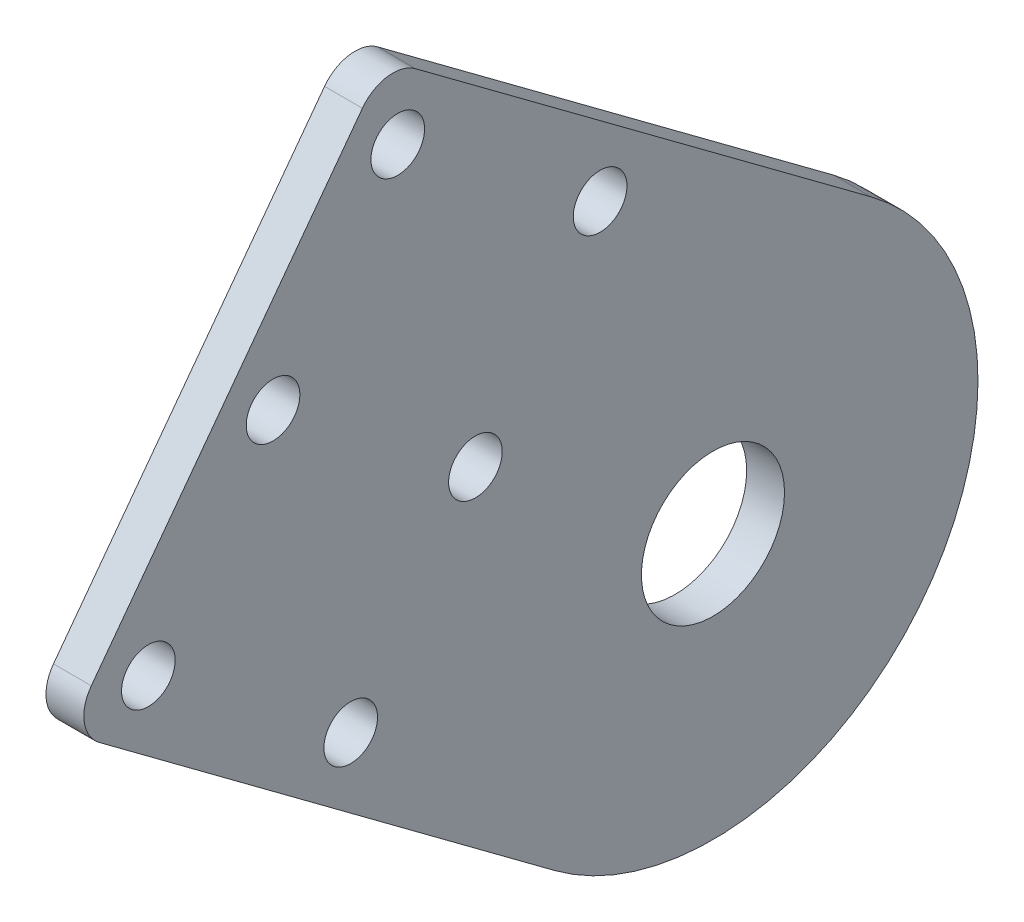
ISO-10303-21;
HEADER;
FILE_DESCRIPTION(('STEP AP214'),'2;1');
FILE_NAME('part.step','',(''),(''),'','','');
FILE_SCHEMA(('AUTOMOTIVE_DESIGN { 1 0 10303 214 1 1 1 1 }'));
ENDSEC;
DATA;
#1=APPLICATION_CONTEXT('core data for automotive mechanical design processes');
#2=APPLICATION_PROTOCOL_DEFINITION('international standard','automotive_design',2000,#1);
#3=PRODUCT_CONTEXT('',#1,'mechanical');
#4=PRODUCT('Part','Part','',(#3));
#5=PRODUCT_RELATED_PRODUCT_CATEGORY('part','',(#4));
#6=PRODUCT_DEFINITION_FORMATION('','',#4);
#7=PRODUCT_DEFINITION_CONTEXT('part definition',#1,'design');
#8=PRODUCT_DEFINITION('design','',#6,#7);
#9=PRODUCT_DEFINITION_SHAPE('','',#8);
#10=(LENGTH_UNIT() NAMED_UNIT(*) SI_UNIT(.MILLI.,.METRE.));
#11=(NAMED_UNIT(*) PLANE_ANGLE_UNIT() SI_UNIT($,.RADIAN.));
#12=(NAMED_UNIT(*) SI_UNIT($,.STERADIAN.) SOLID_ANGLE_UNIT());
#13=UNCERTAINTY_MEASURE_WITH_UNIT(LENGTH_MEASURE(1.E-05),#10,'distance_accuracy_value','');
#14=(GEOMETRIC_REPRESENTATION_CONTEXT(3) GLOBAL_UNCERTAINTY_ASSIGNED_CONTEXT((#13)) GLOBAL_UNIT_ASSIGNED_CONTEXT((#10,
#11,#12)) REPRESENTATION_CONTEXT('',''));
#15=CARTESIAN_POINT('',(0.,0.,0.));
#16=DIRECTION('',(0.,0.,1.));
#17=DIRECTION('',(1.,0.,0.));
#18=AXIS2_PLACEMENT_3D('',#15,#16,#17);
#19=CARTESIAN_POINT('',(3.175,87.5000000000012,-398.98926197498));
#20=DIRECTION('',(1.,0.,0.));
#21=DIRECTION('',(0.,0.,-1.));
#22=AXIS2_PLACEMENT_3D('',#19,#20,#21);
#23=PLANE('',#22);
#24=CARTESIAN_POINT('',(3.175,114.932192950069,-362.096397272571));
#25=DIRECTION('',(1.,0.,0.));
#26=DIRECTION('',(0.,0.,-1.));
#27=AXIS2_PLACEMENT_3D('',#24,#25,#26);
#28=CIRCLE('',#27,2.24999999999995);
#29=CARTESIAN_POINT('',(3.175,114.932192950069,-364.346397272571));
#30=VERTEX_POINT('',#29);
#31=EDGE_CURVE('E209',#30,#30,#28,.T.);
#32=ORIENTED_EDGE('',*,*,#31,.F.);
#33=EDGE_LOOP('',(#32));
#34=FACE_BOUND('',#33,.T.);
#35=CARTESIAN_POINT('',(3.175,128.996323692976,-372.553973590553));
#36=DIRECTION('',(1.,0.,0.));
#37=DIRECTION('',(0.,0.,-1.));
#38=AXIS2_PLACEMENT_3D('',#35,#36,#37);
#39=CIRCLE('',#38,2.24999999999996);
#40=CARTESIAN_POINT('',(3.175,128.996323692976,-374.803973590553));
#41=VERTEX_POINT('',#40);
#42=EDGE_CURVE('E221',#41,#41,#39,.T.);
#43=ORIENTED_EDGE('',*,*,#42,.F.);
#44=EDGE_LOOP('',(#43));
#45=FACE_BOUND('',#44,.T.);
#46=CARTESIAN_POINT('',(3.175,100.868062207161,-351.63882095459));
#47=DIRECTION('',(1.,0.,0.));
#48=DIRECTION('',(0.,0.,-1.));
#49=AXIS2_PLACEMENT_3D('',#46,#47,#48);
#50=CIRCLE('',#49,2.25000000000001);
#51=CARTESIAN_POINT('',(3.175,100.868062207161,-353.88882095459));
#52=VERTEX_POINT('',#51);
#53=EDGE_CURVE('E233',#52,#52,#50,.T.);
#54=ORIENTED_EDGE('',*,*,#53,.F.);
#55=EDGE_LOOP('',(#54));
#56=FACE_BOUND('',#55,.T.);
#57=CARTESIAN_POINT('',(3.175,87.5000000000012,-398.98926197498));
#58=DIRECTION('',(1.,0.,0.));
#59=DIRECTION('',(0.,0.,-1.));
#60=AXIS2_PLACEMENT_3D('',#57,#58,#59);
#61=CIRCLE('',#60,22.225);
#62=CARTESIAN_POINT('',(3.175,69.6650515941403,-385.727842731163));
#63=VERTEX_POINT('',#62);
#64=CARTESIAN_POINT('',(3.175,105.334948405862,-412.250681218797));
#65=VERTEX_POINT('',#64);
#66=EDGE_CURVE('E137',#63,#65,#61,.T.);
#67=ORIENTED_EDGE('',*,*,#66,.T.);
#68=DIRECTION('',(0.,0.596689279811797,0.802472369217582));
#69=VECTOR('',#68,1.);
#70=CARTESIAN_POINT('',(3.175,133.752275356899,-374.03293463481));
#71=LINE('',#70,#69);
#72=CARTESIAN_POINT('',(3.175,133.752275356899,-374.03293463481));
#73=VERTEX_POINT('',#72);
#74=EDGE_CURVE('E95',#65,#73,#71,.T.);
#75=ORIENTED_EDGE('',*,*,#74,.T.);
#76=CARTESIAN_POINT('',(3.175,131.204425584633,-372.138446171408));
#77=DIRECTION('',(1.,0.,0.));
#78=DIRECTION('',(0.,0.,1.));
#79=AXIS2_PLACEMENT_3D('',#76,#77,#78);
#80=CIRCLE('',#79,3.17500000000001);
#81=CARTESIAN_POINT('',(3.175,133.098914048035,-369.590596399142));
#82=VERTEX_POINT('',#81);
#83=EDGE_CURVE('E108',#73,#82,#80,.T.);
#84=ORIENTED_EDGE('',*,*,#83,.T.);
#85=DIRECTION('',(0.,-0.802472369217581,0.596689279811799));
#86=VECTOR('',#85,1.);
#87=CARTESIAN_POINT('',(3.175,102.524716780845,-346.856734838312));
#88=LINE('',#87,#86);
#89=CARTESIAN_POINT('',(3.175,102.524716780845,-346.856734838312));
#90=VERTEX_POINT('',#89);
#91=EDGE_CURVE('E102',#82,#90,#88,.T.);
#92=ORIENTED_EDGE('',*,*,#91,.T.);
#93=CARTESIAN_POINT('',(3.175,100.630228317443,-349.404584610578));
#94=DIRECTION('',(1.,0.,0.));
#95=DIRECTION('',(0.,0.,1.));
#96=AXIS2_PLACEMENT_3D('',#93,#94,#95);
#97=CIRCLE('',#96,3.17500000000002);
#98=CARTESIAN_POINT('',(3.175,98.0823785451771,-347.510096147176));
#99=VERTEX_POINT('',#98);
#100=EDGE_CURVE('E106',#90,#99,#97,.T.);
#101=ORIENTED_EDGE('',*,*,#100,.T.);
#102=DIRECTION('',(0.,-0.596689279811799,-0.802472369217581));
#103=VECTOR('',#102,1.);
#104=CARTESIAN_POINT('',(3.175,69.6650515941403,-385.727842731163));
#105=LINE('',#104,#103);
#106=EDGE_CURVE('E58',#99,#63,#105,.T.);
#107=ORIENTED_EDGE('',*,*,#106,.T.);
#108=EDGE_LOOP('',(#67,#75,#84,#92,#101,#107));
#109=FACE_BOUND('',#108,.T.);
#110=CARTESIAN_POINT('',(3.175,87.5000000000012,-398.98926197498));
#111=DIRECTION('',(1.,0.,0.));
#112=DIRECTION('',(0.,0.,-1.));
#113=AXIS2_PLACEMENT_3D('',#110,#111,#112);
#114=CIRCLE('',#113,5.99999999999999);
#115=CARTESIAN_POINT('',(3.175,87.5000000000012,-404.98926197498));
#116=VERTEX_POINT('',#115);
#117=EDGE_CURVE('E130',#116,#116,#114,.T.);
#118=ORIENTED_EDGE('',*,*,#117,.F.);
#119=EDGE_LOOP('',(#118));
#120=FACE_BOUND('',#119,.T.);
#121=CARTESIAN_POINT('',(3.175,88.2492773177012,-368.609506618803));
#122=DIRECTION('',(1.,0.,0.));
#123=DIRECTION('',(0.,0.,-1.));
#124=AXIS2_PLACEMENT_3D('',#121,#122,#123);
#125=CIRCLE('',#124,2.25000000000001);
#126=CARTESIAN_POINT('',(3.175,88.2492773177012,-370.859506618803));
#127=VERTEX_POINT('',#126);
#128=EDGE_CURVE('E227',#127,#127,#125,.T.);
#129=ORIENTED_EDGE('',*,*,#128,.F.);
#130=EDGE_LOOP('',(#129));
#131=FACE_BOUND('',#130,.T.);
#132=CARTESIAN_POINT('',(3.175,116.377538803516,-389.524659254767));
#133=DIRECTION('',(1.,0.,0.));
#134=DIRECTION('',(0.,0.,-1.));
#135=AXIS2_PLACEMENT_3D('',#132,#133,#134);
#136=CIRCLE('',#135,2.24999999999995);
#137=CARTESIAN_POINT('',(3.175,116.377538803516,-391.774659254767));
#138=VERTEX_POINT('',#137);
#139=EDGE_CURVE('E215',#138,#138,#136,.T.);
#140=ORIENTED_EDGE('',*,*,#139,.F.);
#141=EDGE_LOOP('',(#140));
#142=FACE_BOUND('',#141,.T.);
#143=CARTESIAN_POINT('',(3.175,102.313408060608,-379.067082936785));
#144=DIRECTION('',(1.,0.,0.));
#145=DIRECTION('',(0.,0.,-1.));
#146=AXIS2_PLACEMENT_3D('',#143,#144,#145);
#147=CIRCLE('',#146,2.24999999999995);
#148=CARTESIAN_POINT('',(3.175,102.313408060608,-381.317082936785));
#149=VERTEX_POINT('',#148);
#150=EDGE_CURVE('E200',#149,#149,#147,.T.);
#151=ORIENTED_EDGE('',*,*,#150,.F.);
#152=EDGE_LOOP('',(#151));
#153=FACE_BOUND('',#152,.T.);
#154=ADVANCED_FACE('F41',(#34,#45,#56,#109,#120,#131,#142,#153),#23,.T.);
#155=CARTESIAN_POINT('',(0.,87.5000000000012,-398.98926197498));
#156=DIRECTION('',(1.,0.,0.));
#157=DIRECTION('',(0.,0.,-1.));
#158=AXIS2_PLACEMENT_3D('',#155,#156,#157);
#159=PLANE('',#158);
#160=CARTESIAN_POINT('',(0.,87.5000000000012,-398.98926197498));
#161=DIRECTION('',(1.,0.,0.));
#162=DIRECTION('',(0.,0.,-1.));
#163=AXIS2_PLACEMENT_3D('',#160,#161,#162);
#164=CIRCLE('',#163,22.225);
#165=CARTESIAN_POINT('',(0.,69.6650515941403,-385.727842731163));
#166=VERTEX_POINT('',#165);
#167=CARTESIAN_POINT('',(0.,105.334948405862,-412.250681218797));
#168=VERTEX_POINT('',#167);
#169=EDGE_CURVE('E126',#166,#168,#164,.T.);
#170=ORIENTED_EDGE('',*,*,#169,.F.);
#171=DIRECTION('',(0.,-0.596689279811799,-0.802472369217581));
#172=VECTOR('',#171,1.);
#173=CARTESIAN_POINT('',(0.,69.6650515941403,-385.727842731163));
#174=LINE('',#173,#172);
#175=CARTESIAN_POINT('',(0.,98.0823785451771,-347.510096147176));
#176=VERTEX_POINT('',#175);
#177=EDGE_CURVE('E87',#176,#166,#174,.T.);
#178=ORIENTED_EDGE('',*,*,#177,.F.);
#179=CARTESIAN_POINT('',(0.,100.630228317443,-349.404584610578));
#180=DIRECTION('',(1.,0.,0.));
#181=DIRECTION('',(0.,0.,1.));
#182=AXIS2_PLACEMENT_3D('',#179,#180,#181);
#183=CIRCLE('',#182,3.17500000000002);
#184=CARTESIAN_POINT('',(0.,102.524716780845,-346.856734838312));
#185=VERTEX_POINT('',#184);
#186=EDGE_CURVE('E81',#185,#176,#183,.T.);
#187=ORIENTED_EDGE('',*,*,#186,.F.);
#188=DIRECTION('',(0.,-0.802472369217581,0.596689279811799));
#189=VECTOR('',#188,1.);
#190=CARTESIAN_POINT('',(0.,102.524716780845,-346.856734838312));
#191=LINE('',#190,#189);
#192=CARTESIAN_POINT('',(0.,133.098914048035,-369.590596399142));
#193=VERTEX_POINT('',#192);
#194=EDGE_CURVE('E116',#193,#185,#191,.T.);
#195=ORIENTED_EDGE('',*,*,#194,.F.);
#196=CARTESIAN_POINT('',(0.,131.204425584633,-372.138446171408));
#197=DIRECTION('',(1.,0.,0.));
#198=DIRECTION('',(0.,0.,1.));
#199=AXIS2_PLACEMENT_3D('',#196,#197,#198);
#200=CIRCLE('',#199,3.17500000000001);
#201=CARTESIAN_POINT('',(0.,133.752275356899,-374.03293463481));
#202=VERTEX_POINT('',#201);
#203=EDGE_CURVE('E132',#202,#193,#200,.T.);
#204=ORIENTED_EDGE('',*,*,#203,.F.);
#205=DIRECTION('',(0.,0.596689279811797,0.802472369217582));
#206=VECTOR('',#205,1.);
#207=CARTESIAN_POINT('',(0.,133.752275356899,-374.03293463481));
#208=LINE('',#207,#206);
#209=EDGE_CURVE('E129',#168,#202,#208,.T.);
#210=ORIENTED_EDGE('',*,*,#209,.F.);
#211=EDGE_LOOP('',(#170,#178,#187,#195,#204,#210));
#212=FACE_BOUND('',#211,.T.);
#213=CARTESIAN_POINT('',(0.,87.5000000000012,-398.98926197498));
#214=DIRECTION('',(1.,0.,0.));
#215=DIRECTION('',(0.,0.,-1.));
#216=AXIS2_PLACEMENT_3D('',#213,#214,#215);
#217=CIRCLE('',#216,5.99999999999999);
#218=CARTESIAN_POINT('',(0.,87.5000000000012,-404.98926197498));
#219=VERTEX_POINT('',#218);
#220=EDGE_CURVE('E236',#219,#219,#217,.T.);
#221=ORIENTED_EDGE('',*,*,#220,.T.);
#222=EDGE_LOOP('',(#221));
#223=FACE_BOUND('',#222,.T.);
#224=CARTESIAN_POINT('',(0.,100.868062207161,-351.63882095459));
#225=DIRECTION('',(1.,0.,0.));
#226=DIRECTION('',(0.,0.,-1.));
#227=AXIS2_PLACEMENT_3D('',#224,#225,#226);
#228=CIRCLE('',#227,2.25000000000001);
#229=CARTESIAN_POINT('',(0.,100.868062207161,-353.88882095459));
#230=VERTEX_POINT('',#229);
#231=EDGE_CURVE('E230',#230,#230,#228,.T.);
#232=ORIENTED_EDGE('',*,*,#231,.T.);
#233=EDGE_LOOP('',(#232));
#234=FACE_BOUND('',#233,.T.);
#235=CARTESIAN_POINT('',(0.,88.2492773177012,-368.609506618803));
#236=DIRECTION('',(1.,0.,0.));
#237=DIRECTION('',(0.,0.,-1.));
#238=AXIS2_PLACEMENT_3D('',#235,#236,#237);
#239=CIRCLE('',#238,2.25000000000001);
#240=CARTESIAN_POINT('',(0.,88.2492773177012,-370.859506618803));
#241=VERTEX_POINT('',#240);
#242=EDGE_CURVE('E224',#241,#241,#239,.T.);
#243=ORIENTED_EDGE('',*,*,#242,.T.);
#244=EDGE_LOOP('',(#243));
#245=FACE_BOUND('',#244,.T.);
#246=CARTESIAN_POINT('',(0.,128.996323692976,-372.553973590553));
#247=DIRECTION('',(1.,0.,0.));
#248=DIRECTION('',(0.,0.,-1.));
#249=AXIS2_PLACEMENT_3D('',#246,#247,#248);
#250=CIRCLE('',#249,2.24999999999996);
#251=CARTESIAN_POINT('',(0.,128.996323692976,-374.803973590553));
#252=VERTEX_POINT('',#251);
#253=EDGE_CURVE('E218',#252,#252,#250,.T.);
#254=ORIENTED_EDGE('',*,*,#253,.T.);
#255=EDGE_LOOP('',(#254));
#256=FACE_BOUND('',#255,.T.);
#257=CARTESIAN_POINT('',(0.,116.377538803516,-389.524659254767));
#258=DIRECTION('',(1.,0.,0.));
#259=DIRECTION('',(0.,0.,-1.));
#260=AXIS2_PLACEMENT_3D('',#257,#258,#259);
#261=CIRCLE('',#260,2.24999999999995);
#262=CARTESIAN_POINT('',(0.,116.377538803516,-391.774659254767));
#263=VERTEX_POINT('',#262);
#264=EDGE_CURVE('E212',#263,#263,#261,.T.);
#265=ORIENTED_EDGE('',*,*,#264,.T.);
#266=EDGE_LOOP('',(#265));
#267=FACE_BOUND('',#266,.T.);
#268=CARTESIAN_POINT('',(0.,114.932192950069,-362.096397272571));
#269=DIRECTION('',(1.,0.,0.));
#270=DIRECTION('',(0.,0.,-1.));
#271=AXIS2_PLACEMENT_3D('',#268,#269,#270);
#272=CIRCLE('',#271,2.24999999999995);
#273=CARTESIAN_POINT('',(0.,114.932192950069,-364.346397272571));
#274=VERTEX_POINT('',#273);
#275=EDGE_CURVE('E206',#274,#274,#272,.T.);
#276=ORIENTED_EDGE('',*,*,#275,.T.);
#277=EDGE_LOOP('',(#276));
#278=FACE_BOUND('',#277,.T.);
#279=CARTESIAN_POINT('',(0.,102.313408060608,-379.067082936785));
#280=DIRECTION('',(1.,0.,0.));
#281=DIRECTION('',(0.,0.,-1.));
#282=AXIS2_PLACEMENT_3D('',#279,#280,#281);
#283=CIRCLE('',#282,2.24999999999995);
#284=CARTESIAN_POINT('',(0.,102.313408060608,-381.317082936785));
#285=VERTEX_POINT('',#284);
#286=EDGE_CURVE('E203',#285,#285,#283,.T.);
#287=ORIENTED_EDGE('',*,*,#286,.T.);
#288=EDGE_LOOP('',(#287));
#289=FACE_BOUND('',#288,.T.);
#290=ADVANCED_FACE('F146',(#212,#223,#234,#245,#256,#267,#278,#289),#159,.F.);
#291=CARTESIAN_POINT('',(3.175,87.5000000000012,-398.98926197498));
#292=DIRECTION('',(-1.,0.,0.));
#293=DIRECTION('',(0.,0.,1.));
#294=AXIS2_PLACEMENT_3D('',#291,#292,#293);
#295=CYLINDRICAL_SURFACE('',#294,22.225);
#296=ORIENTED_EDGE('',*,*,#169,.T.);
#297=DIRECTION('',(-1.,0.,0.));
#298=VECTOR('',#297,1.);
#299=CARTESIAN_POINT('',(3.175,105.334948405862,-412.250681218797));
#300=LINE('',#299,#298);
#301=EDGE_CURVE('E11',#65,#168,#300,.T.);
#302=ORIENTED_EDGE('',*,*,#301,.F.);
#303=ORIENTED_EDGE('',*,*,#66,.F.);
#304=DIRECTION('',(-1.,0.,0.));
#305=VECTOR('',#304,1.);
#306=CARTESIAN_POINT('',(3.175,69.6650515941403,-385.727842731163));
#307=LINE('',#306,#305);
#308=EDGE_CURVE('E122',#63,#166,#307,.T.);
#309=ORIENTED_EDGE('',*,*,#308,.T.);
#310=EDGE_LOOP('',(#296,#302,#303,#309));
#311=FACE_BOUND('',#310,.T.);
#312=ADVANCED_FACE('F43',(#311),#295,.T.);
#313=CARTESIAN_POINT('',(3.175,133.752275356899,-374.03293463481));
#314=DIRECTION('',(0.,-0.802472369217582,0.596689279811797));
#315=DIRECTION('',(0.,-0.596689279811797,-0.802472369217582));
#316=AXIS2_PLACEMENT_3D('',#313,#314,#315);
#317=PLANE('',#316);
#318=ORIENTED_EDGE('',*,*,#209,.T.);
#319=DIRECTION('',(-1.,0.,0.));
#320=VECTOR('',#319,1.);
#321=CARTESIAN_POINT('',(3.175,133.752275356899,-374.03293463481));
#322=LINE('',#321,#320);
#323=EDGE_CURVE('E50',#73,#202,#322,.T.);
#324=ORIENTED_EDGE('',*,*,#323,.F.);
#325=ORIENTED_EDGE('',*,*,#74,.F.);
#326=ORIENTED_EDGE('',*,*,#301,.T.);
#327=EDGE_LOOP('',(#318,#324,#325,#326));
#328=FACE_BOUND('',#327,.T.);
#329=ADVANCED_FACE('F328',(#328),#317,.F.);
#330=CARTESIAN_POINT('',(3.175,131.204425584633,-372.138446171408));
#331=DIRECTION('',(-1.,0.,0.));
#332=DIRECTION('',(0.,0.,1.));
#333=AXIS2_PLACEMENT_3D('',#330,#331,#332);
#334=CYLINDRICAL_SURFACE('',#333,3.17500000000001);
#335=ORIENTED_EDGE('',*,*,#203,.T.);
#336=DIRECTION('',(-1.,0.,0.));
#337=VECTOR('',#336,1.);
#338=CARTESIAN_POINT('',(3.175,133.098914048035,-369.590596399142));
#339=LINE('',#338,#337);
#340=EDGE_CURVE('E117',#82,#193,#339,.T.);
#341=ORIENTED_EDGE('',*,*,#340,.F.);
#342=ORIENTED_EDGE('',*,*,#83,.F.);
#343=ORIENTED_EDGE('',*,*,#323,.T.);
#344=EDGE_LOOP('',(#335,#341,#342,#343));
#345=FACE_BOUND('',#344,.T.);
#346=ADVANCED_FACE('F143',(#345),#334,.T.);
#347=CARTESIAN_POINT('',(3.175,102.524716780845,-346.856734838312));
#348=DIRECTION('',(0.,-0.596689279811799,-0.802472369217581));
#349=DIRECTION('',(0.,0.802472369217581,-0.596689279811799));
#350=AXIS2_PLACEMENT_3D('',#347,#348,#349);
#351=PLANE('',#350);
#352=ORIENTED_EDGE('',*,*,#194,.T.);
#353=DIRECTION('',(-1.,0.,0.));
#354=VECTOR('',#353,1.);
#355=CARTESIAN_POINT('',(3.175,102.524716780845,-346.856734838312));
#356=LINE('',#355,#354);
#357=EDGE_CURVE('E113',#90,#185,#356,.T.);
#358=ORIENTED_EDGE('',*,*,#357,.F.);
#359=ORIENTED_EDGE('',*,*,#91,.F.);
#360=ORIENTED_EDGE('',*,*,#340,.T.);
#361=EDGE_LOOP('',(#352,#358,#359,#360));
#362=FACE_BOUND('',#361,.T.);
#363=ADVANCED_FACE('F114',(#362),#351,.F.);
#364=CARTESIAN_POINT('',(3.175,100.630228317443,-349.404584610578));
#365=DIRECTION('',(-1.,0.,0.));
#366=DIRECTION('',(0.,0.,1.));
#367=AXIS2_PLACEMENT_3D('',#364,#365,#366);
#368=CYLINDRICAL_SURFACE('',#367,3.17500000000002);
#369=ORIENTED_EDGE('',*,*,#186,.T.);
#370=DIRECTION('',(-1.,0.,0.));
#371=VECTOR('',#370,1.);
#372=CARTESIAN_POINT('',(3.175,98.0823785451771,-347.510096147176));
#373=LINE('',#372,#371);
#374=EDGE_CURVE('E118',#99,#176,#373,.T.);
#375=ORIENTED_EDGE('',*,*,#374,.F.);
#376=ORIENTED_EDGE('',*,*,#100,.F.);
#377=ORIENTED_EDGE('',*,*,#357,.T.);
#378=EDGE_LOOP('',(#369,#375,#376,#377));
#379=FACE_BOUND('',#378,.T.);
#380=ADVANCED_FACE('F120',(#379),#368,.T.);
#381=CARTESIAN_POINT('',(3.175,69.6650515941403,-385.727842731163));
#382=DIRECTION('',(0.,0.802472369217581,-0.596689279811799));
#383=DIRECTION('',(0.,0.596689279811799,0.802472369217581));
#384=AXIS2_PLACEMENT_3D('',#381,#382,#383);
#385=PLANE('',#384);
#386=ORIENTED_EDGE('',*,*,#177,.T.);
#387=ORIENTED_EDGE('',*,*,#308,.F.);
#388=ORIENTED_EDGE('',*,*,#106,.F.);
#389=ORIENTED_EDGE('',*,*,#374,.T.);
#390=EDGE_LOOP('',(#386,#387,#388,#389));
#391=FACE_BOUND('',#390,.T.);
#392=ADVANCED_FACE('F151',(#391),#385,.F.);
#393=CARTESIAN_POINT('',(3.175,87.5000000000012,-398.98926197498));
#394=DIRECTION('',(-1.,0.,0.));
#395=DIRECTION('',(0.,0.,1.));
#396=AXIS2_PLACEMENT_3D('',#393,#394,#395);
#397=CYLINDRICAL_SURFACE('',#396,5.99999999999999);
#398=ORIENTED_EDGE('',*,*,#117,.T.);
#399=EDGE_LOOP('',(#398));
#400=FACE_BOUND('',#399,.T.);
#401=ORIENTED_EDGE('',*,*,#220,.F.);
#402=EDGE_LOOP('',(#401));
#403=FACE_BOUND('',#402,.T.);
#404=ADVANCED_FACE('F153',(#400,#403),#397,.F.);
#405=CARTESIAN_POINT('',(3.175,100.868062207161,-351.63882095459));
#406=DIRECTION('',(-1.,0.,0.));
#407=DIRECTION('',(0.,0.,1.));
#408=AXIS2_PLACEMENT_3D('',#405,#406,#407);
#409=CYLINDRICAL_SURFACE('',#408,2.25000000000001);
#410=ORIENTED_EDGE('',*,*,#53,.T.);
#411=EDGE_LOOP('',(#410));
#412=FACE_BOUND('',#411,.T.);
#413=ORIENTED_EDGE('',*,*,#231,.F.);
#414=EDGE_LOOP('',(#413));
#415=FACE_BOUND('',#414,.T.);
#416=ADVANCED_FACE('F159',(#412,#415),#409,.F.);
#417=CARTESIAN_POINT('',(3.175,88.2492773177012,-368.609506618803));
#418=DIRECTION('',(-1.,0.,0.));
#419=DIRECTION('',(0.,0.,1.));
#420=AXIS2_PLACEMENT_3D('',#417,#418,#419);
#421=CYLINDRICAL_SURFACE('',#420,2.25000000000001);
#422=ORIENTED_EDGE('',*,*,#128,.T.);
#423=EDGE_LOOP('',(#422));
#424=FACE_BOUND('',#423,.T.);
#425=ORIENTED_EDGE('',*,*,#242,.F.);
#426=EDGE_LOOP('',(#425));
#427=FACE_BOUND('',#426,.T.);
#428=ADVANCED_FACE('F175',(#424,#427),#421,.F.);
#429=CARTESIAN_POINT('',(3.175,128.996323692976,-372.553973590553));
#430=DIRECTION('',(-1.,0.,0.));
#431=DIRECTION('',(0.,0.,1.));
#432=AXIS2_PLACEMENT_3D('',#429,#430,#431);
#433=CYLINDRICAL_SURFACE('',#432,2.24999999999996);
#434=ORIENTED_EDGE('',*,*,#42,.T.);
#435=EDGE_LOOP('',(#434));
#436=FACE_BOUND('',#435,.T.);
#437=ORIENTED_EDGE('',*,*,#253,.F.);
#438=EDGE_LOOP('',(#437));
#439=FACE_BOUND('',#438,.T.);
#440=ADVANCED_FACE('F179',(#436,#439),#433,.F.);
#441=CARTESIAN_POINT('',(3.175,116.377538803516,-389.524659254767));
#442=DIRECTION('',(-1.,0.,0.));
#443=DIRECTION('',(0.,0.,1.));
#444=AXIS2_PLACEMENT_3D('',#441,#442,#443);
#445=CYLINDRICAL_SURFACE('',#444,2.24999999999995);
#446=ORIENTED_EDGE('',*,*,#139,.T.);
#447=EDGE_LOOP('',(#446));
#448=FACE_BOUND('',#447,.T.);
#449=ORIENTED_EDGE('',*,*,#264,.F.);
#450=EDGE_LOOP('',(#449));
#451=FACE_BOUND('',#450,.T.);
#452=ADVANCED_FACE('F183',(#448,#451),#445,.F.);
#453=CARTESIAN_POINT('',(3.175,114.932192950069,-362.096397272571));
#454=DIRECTION('',(-1.,0.,0.));
#455=DIRECTION('',(0.,0.,1.));
#456=AXIS2_PLACEMENT_3D('',#453,#454,#455);
#457=CYLINDRICAL_SURFACE('',#456,2.24999999999995);
#458=ORIENTED_EDGE('',*,*,#31,.T.);
#459=EDGE_LOOP('',(#458));
#460=FACE_BOUND('',#459,.T.);
#461=ORIENTED_EDGE('',*,*,#275,.F.);
#462=EDGE_LOOP('',(#461));
#463=FACE_BOUND('',#462,.T.);
#464=ADVANCED_FACE('F187',(#460,#463),#457,.F.);
#465=CARTESIAN_POINT('',(3.175,102.313408060608,-379.067082936785));
#466=DIRECTION('',(-1.,0.,0.));
#467=DIRECTION('',(0.,0.,1.));
#468=AXIS2_PLACEMENT_3D('',#465,#466,#467);
#469=CYLINDRICAL_SURFACE('',#468,2.24999999999995);
#470=ORIENTED_EDGE('',*,*,#150,.T.);
#471=EDGE_LOOP('',(#470));
#472=FACE_BOUND('',#471,.T.);
#473=ORIENTED_EDGE('',*,*,#286,.F.);
#474=EDGE_LOOP('',(#473));
#475=FACE_BOUND('',#474,.T.);
#476=ADVANCED_FACE('F191',(#472,#475),#469,.F.);
#477=CLOSED_SHELL('',(#154,#290,#312,#329,#346,#363,#380,#392,#404,#416,#428,#440,#452,#464,#476));
#478=MANIFOLD_SOLID_BREP('B2',#477);
#479=ADVANCED_BREP_SHAPE_REPRESENTATION('',(#18,#478),#14);
#480=SHAPE_DEFINITION_REPRESENTATION(#9,#479);
ENDSEC;
END-ISO-10303-21;
